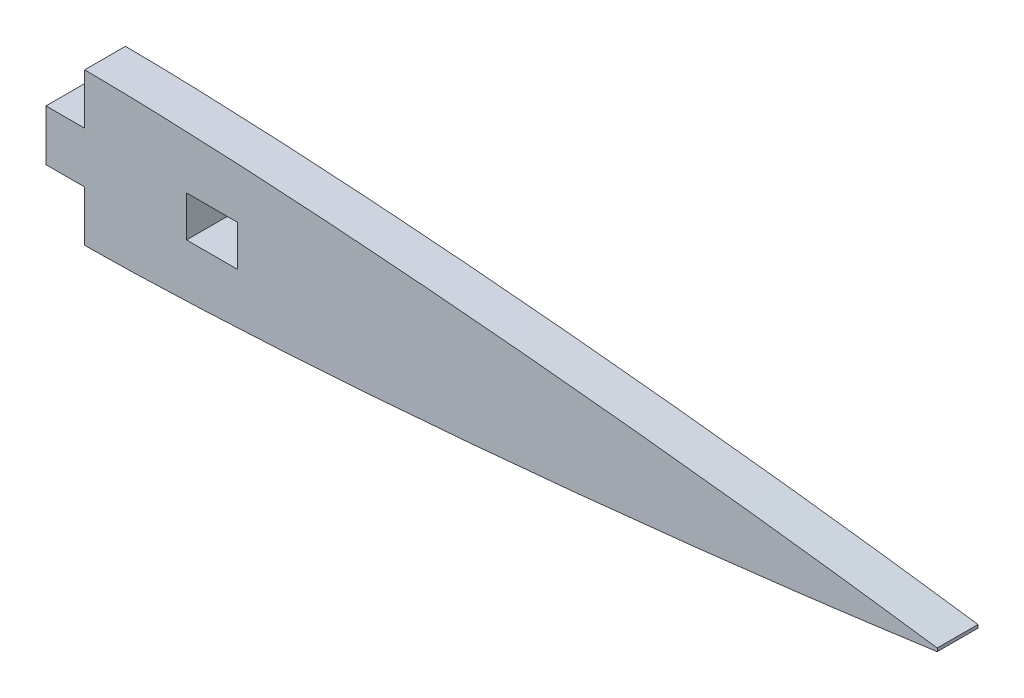
ISO-10303-21;
HEADER;
FILE_DESCRIPTION(('STEP AP214'),'2;1');
FILE_NAME('part.step','',(''),(''),'','','');
FILE_SCHEMA(('AUTOMOTIVE_DESIGN { 1 0 10303 214 1 1 1 1 }'));
ENDSEC;
DATA;
#1=APPLICATION_CONTEXT('core data for automotive mechanical design processes');
#2=APPLICATION_PROTOCOL_DEFINITION('international standard','automotive_design',2000,#1);
#3=PRODUCT_CONTEXT('',#1,'mechanical');
#4=PRODUCT('Part','Part','',(#3));
#5=PRODUCT_RELATED_PRODUCT_CATEGORY('part','',(#4));
#6=PRODUCT_DEFINITION_FORMATION('','',#4);
#7=PRODUCT_DEFINITION_CONTEXT('part definition',#1,'design');
#8=PRODUCT_DEFINITION('design','',#6,#7);
#9=PRODUCT_DEFINITION_SHAPE('','',#8);
#10=(LENGTH_UNIT() NAMED_UNIT(*) SI_UNIT(.MILLI.,.METRE.));
#11=(NAMED_UNIT(*) PLANE_ANGLE_UNIT() SI_UNIT($,.RADIAN.));
#12=(NAMED_UNIT(*) SI_UNIT($,.STERADIAN.) SOLID_ANGLE_UNIT());
#13=UNCERTAINTY_MEASURE_WITH_UNIT(LENGTH_MEASURE(1.E-05),#10,'distance_accuracy_value','');
#14=(GEOMETRIC_REPRESENTATION_CONTEXT(3) GLOBAL_UNCERTAINTY_ASSIGNED_CONTEXT((#13)) GLOBAL_UNIT_ASSIGNED_CONTEXT((#10,
#11,#12)) REPRESENTATION_CONTEXT('',''));
#15=CARTESIAN_POINT('',(0.,0.,0.));
#16=DIRECTION('',(0.,0.,1.));
#17=DIRECTION('',(1.,0.,0.));
#18=AXIS2_PLACEMENT_3D('',#15,#16,#17);
#19=CARTESIAN_POINT('',(47.625,-9.52576331040314,5.08));
#20=CARTESIAN_POINT('',(50.2177356566735,-9.48719248214332,5.08));
#21=CARTESIAN_POINT('',(55.4582966324732,-9.48903947983647,5.08));
#22=CARTESIAN_POINT('',(63.3434162274875,-9.23480821011702,5.08));
#23=CARTESIAN_POINT('',(71.3345095377818,-8.88842608962695,5.08));
#24=CARTESIAN_POINT('',(79.324754405376,-8.42059946297436,5.08));
#25=CARTESIAN_POINT('',(87.3152385206949,-7.87391719763501,5.08));
#26=CARTESIAN_POINT('',(95.252619426882,-7.25396232739253,5.08));
#27=CARTESIAN_POINT('',(103.190287717265,-6.57149538859201,5.08));
#28=CARTESIAN_POINT('',(111.127662781583,-5.82540228155454,5.08));
#29=CARTESIAN_POINT('',(119.065195908497,-5.02492375961748,5.08));
#30=CARTESIAN_POINT('',(127.002836923673,-4.17220658565676,5.08));
#31=CARTESIAN_POINT('',(134.940769513473,-3.26840822682621,5.08));
#32=CARTESIAN_POINT('',(142.878358215207,-2.30671923378164,5.08));
#33=CARTESIAN_POINT('',(150.817056987184,-1.29426944217571,5.08));
#34=CARTESIAN_POINT('',(156.104769638528,-0.56489950075565,5.08));
#35=CARTESIAN_POINT('',(158.750000000014,-0.200024999999788,5.08));
#36=B_SPLINE_CURVE_WITH_KNOTS('',3,(#19,#20,#21,#22,#23,#24,#25,#26,#27,#28,#29,#30,#31,#32,#33,
#34,#35),.UNSPECIFIED.,.F.,.F.,(4,1,1,1,1,1,1,1,1,1,1,1,1,1,4),(0.656846271918045,
0.680768176909528,0.70518703148146,0.729619521717807,0.754557907488244,0.779023813920224,
0.803506447849447,0.828005419452442,0.852521438169042,0.87705400352829,0.901603249022864,
0.926170219757915,0.950757129502437,0.975365768770781,1.),.UNSPECIFIED.);
#37=DIRECTION('',(0.,0.,-1.));
#38=VECTOR('',#37,1.);
#39=SURFACE_OF_LINEAR_EXTRUSION('',#36,#38);
#40=CARTESIAN_POINT('',(52.4510000000001,-9.48015605351682,5.08));
#41=VERTEX_POINT('',#40);
#42=CARTESIAN_POINT('',(158.750000000014,-0.200024999999788,5.08));
#43=VERTEX_POINT('',#42);
#44=EDGE_CURVE('E181',#41,#43,#36,.T.);
#45=ORIENTED_EDGE('',*,*,#44,.F.);
#46=DIRECTION('',(0.,0.,-1.));
#47=VECTOR('',#46,1.);
#48=CARTESIAN_POINT('',(52.4510000000001,-9.48015605351683,5.08));
#49=LINE('',#48,#47);
#50=CARTESIAN_POINT('',(52.4510000000001,-9.48015605351682,0.));
#51=VERTEX_POINT('',#50);
#52=EDGE_CURVE('E168',#41,#51,#49,.T.);
#53=ORIENTED_EDGE('',*,*,#52,.T.);
#54=CARTESIAN_POINT('',(47.625,-9.52576331040314,0.));
#55=CARTESIAN_POINT('',(50.2177356566735,-9.48719248214332,0.));
#56=CARTESIAN_POINT('',(55.4582966324732,-9.48903947983647,0.));
#57=CARTESIAN_POINT('',(63.3434162274875,-9.23480821011702,0.));
#58=CARTESIAN_POINT('',(71.3345095377818,-8.88842608962695,0.));
#59=CARTESIAN_POINT('',(79.324754405376,-8.42059946297436,0.));
#60=CARTESIAN_POINT('',(87.3152385206949,-7.87391719763501,0.));
#61=CARTESIAN_POINT('',(95.252619426882,-7.25396232739253,0.));
#62=CARTESIAN_POINT('',(103.190287717265,-6.57149538859201,0.));
#63=CARTESIAN_POINT('',(111.127662781583,-5.82540228155454,0.));
#64=CARTESIAN_POINT('',(119.065195908497,-5.02492375961748,0.));
#65=CARTESIAN_POINT('',(127.002836923673,-4.17220658565676,0.));
#66=CARTESIAN_POINT('',(134.940769513473,-3.26840822682621,0.));
#67=CARTESIAN_POINT('',(142.878358215207,-2.30671923378164,0.));
#68=CARTESIAN_POINT('',(150.817056987184,-1.29426944217571,0.));
#69=CARTESIAN_POINT('',(156.104769638528,-0.56489950075565,0.));
#70=CARTESIAN_POINT('',(158.750000000014,-0.200024999999788,0.));
#71=B_SPLINE_CURVE_WITH_KNOTS('',3,(#54,#55,#56,#57,#58,#59,#60,#61,#62,#63,#64,#65,#66,#67,#68,
#69,#70),.UNSPECIFIED.,.F.,.F.,(4,1,1,1,1,1,1,1,1,1,1,1,1,1,4),(0.656846271918045,
0.680768176909528,0.70518703148146,0.729619521717807,0.754557907488244,0.779023813920224,
0.803506447849447,0.828005419452442,0.852521438169042,0.87705400352829,0.901603249022864,
0.926170219757915,0.950757129502437,0.975365768770781,1.),.UNSPECIFIED.);
#72=CARTESIAN_POINT('',(158.750000000014,-0.200024999999788,0.));
#73=VERTEX_POINT('',#72);
#74=EDGE_CURVE('E163',#51,#73,#71,.T.);
#75=ORIENTED_EDGE('',*,*,#74,.T.);
#76=DIRECTION('',(0.,0.,-1.));
#77=VECTOR('',#76,1.);
#78=CARTESIAN_POINT('',(158.750000000014,-0.200024999999788,5.08));
#79=LINE('',#78,#77);
#80=EDGE_CURVE('E41',#43,#73,#79,.T.);
#81=ORIENTED_EDGE('',*,*,#80,.F.);
#82=EDGE_LOOP('',(#45,#53,#75,#81));
#83=FACE_BOUND('',#82,.T.);
#84=ADVANCED_FACE('F33',(#83),#39,.F.);
#85=CARTESIAN_POINT('',(158.750000000014,-0.200024999999788,5.08));
#86=DIRECTION('',(-1.,0.,0.));
#87=DIRECTION('',(0.,0.,1.));
#88=AXIS2_PLACEMENT_3D('',#85,#86,#87);
#89=PLANE('',#88);
#90=DIRECTION('',(0.,1.,0.));
#91=VECTOR('',#90,1.);
#92=CARTESIAN_POINT('',(158.750000000014,-0.200024999999788,0.));
#93=LINE('',#92,#91);
#94=CARTESIAN_POINT('',(158.750000000014,0.200025000170092,0.));
#95=VERTEX_POINT('',#94);
#96=EDGE_CURVE('E167',#73,#95,#93,.T.);
#97=ORIENTED_EDGE('',*,*,#96,.T.);
#98=DIRECTION('',(0.,0.,-1.));
#99=VECTOR('',#98,1.);
#100=CARTESIAN_POINT('',(158.750000000014,0.200025000170092,5.08));
#101=LINE('',#100,#99);
#102=CARTESIAN_POINT('',(158.750000000014,0.200025000170092,5.08));
#103=VERTEX_POINT('',#102);
#104=EDGE_CURVE('E150',#103,#95,#101,.T.);
#105=ORIENTED_EDGE('',*,*,#104,.F.);
#106=DIRECTION('',(0.,1.,0.));
#107=VECTOR('',#106,1.);
#108=CARTESIAN_POINT('',(158.750000000014,-0.200024999999788,5.08));
#109=LINE('',#108,#107);
#110=EDGE_CURVE('E156',#43,#103,#109,.T.);
#111=ORIENTED_EDGE('',*,*,#110,.F.);
#112=ORIENTED_EDGE('',*,*,#80,.T.);
#113=EDGE_LOOP('',(#97,#105,#111,#112));
#114=FACE_BOUND('',#113,.T.);
#115=ADVANCED_FACE('F186',(#114),#89,.F.);
#116=CARTESIAN_POINT('',(158.750000000014,0.200025000170092,5.08));
#117=CARTESIAN_POINT('',(156.104769638527,0.564899500921906,5.08));
#118=CARTESIAN_POINT('',(150.817056987182,1.29426944233387,5.08));
#119=CARTESIAN_POINT('',(142.878358215204,2.30671923392764,5.08));
#120=CARTESIAN_POINT('',(134.940769513469,3.26840822696008,5.08));
#121=CARTESIAN_POINT('',(127.002836923667,4.17220658577847,5.08));
#122=CARTESIAN_POINT('',(119.06519590849,5.02492375972704,5.08));
#123=CARTESIAN_POINT('',(111.127662781574,5.82540228165196,5.08));
#124=CARTESIAN_POINT('',(103.190287717255,6.57149538867727,5.08));
#125=CARTESIAN_POINT('',(95.2526194268712,7.25396232746564,5.08));
#126=CARTESIAN_POINT('',(87.3152385206832,7.87391719769598,5.08));
#127=CARTESIAN_POINT('',(79.3247544053635,8.42059946302309,5.08));
#128=CARTESIAN_POINT('',(71.3345095377685,8.88842608966345,5.08));
#129=CARTESIAN_POINT('',(63.3434162274737,9.2348082101413,5.08));
#130=CARTESIAN_POINT('',(55.4582966324637,9.48903947984852,5.08));
#131=CARTESIAN_POINT('',(50.2177356566689,9.48719248214751,5.08));
#132=CARTESIAN_POINT('',(47.625,9.52576331040314,5.08));
#133=B_SPLINE_CURVE_WITH_KNOTS('',3,(#116,#117,#118,#119,#120,#121,#122,#123,#124,#125,#126,
#127,#128,#129,#130,#131,#132),.UNSPECIFIED.,.F.,.F.,(4,1,1,1,1,1,1,1,1,1,1,1,1,1,4),(0.,
0.0246342312292194,0.0492428704975633,0.0738297802420855,0.0983967509771365,0.12294599647171,
0.147478561830958,0.171994580547558,0.196493552150553,0.220976186079776,0.245442092511756,
0.270380478282193,0.29481296851854,0.319231823090472,0.343153728081911),.UNSPECIFIED.);
#134=DIRECTION('',(0.,0.,-1.));
#135=VECTOR('',#134,1.);
#136=SURFACE_OF_LINEAR_EXTRUSION('',#133,#135);
#137=CARTESIAN_POINT('',(158.750000000014,0.200025000170092,0.));
#138=CARTESIAN_POINT('',(156.104769638527,0.564899500921906,0.));
#139=CARTESIAN_POINT('',(150.817056987182,1.29426944233387,0.));
#140=CARTESIAN_POINT('',(142.878358215204,2.30671923392764,0.));
#141=CARTESIAN_POINT('',(134.940769513469,3.26840822696008,0.));
#142=CARTESIAN_POINT('',(127.002836923667,4.17220658577847,0.));
#143=CARTESIAN_POINT('',(119.06519590849,5.02492375972704,0.));
#144=CARTESIAN_POINT('',(111.127662781574,5.82540228165196,0.));
#145=CARTESIAN_POINT('',(103.190287717255,6.57149538867727,0.));
#146=CARTESIAN_POINT('',(95.2526194268712,7.25396232746564,0.));
#147=CARTESIAN_POINT('',(87.3152385206832,7.87391719769598,0.));
#148=CARTESIAN_POINT('',(79.3247544053635,8.42059946302309,0.));
#149=CARTESIAN_POINT('',(71.3345095377685,8.88842608966345,0.));
#150=CARTESIAN_POINT('',(63.3434162274737,9.2348082101413,0.));
#151=CARTESIAN_POINT('',(55.4582966324637,9.48903947984852,0.));
#152=CARTESIAN_POINT('',(50.2177356566689,9.48719248214751,0.));
#153=CARTESIAN_POINT('',(47.625,9.52576331040314,0.));
#154=B_SPLINE_CURVE_WITH_KNOTS('',3,(#137,#138,#139,#140,#141,#142,#143,#144,#145,#146,#147,
#148,#149,#150,#151,#152,#153),.UNSPECIFIED.,.F.,.F.,(4,1,1,1,1,1,1,1,1,1,1,1,1,1,4),(0.,
0.0246342312292194,0.0492428704975633,0.0738297802420855,0.0983967509771365,0.12294599647171,
0.147478561830958,0.171994580547558,0.196493552150553,0.220976186079776,0.245442092511756,
0.270380478282193,0.29481296851854,0.319231823090472,0.343153728081911),.UNSPECIFIED.);
#155=CARTESIAN_POINT('',(52.4510000000016,9.48015605352431,0.));
#156=VERTEX_POINT('',#155);
#157=EDGE_CURVE('E173',#95,#156,#154,.T.);
#158=ORIENTED_EDGE('',*,*,#157,.T.);
#159=DIRECTION('',(0.,0.,-1.));
#160=VECTOR('',#159,1.);
#161=CARTESIAN_POINT('',(52.4510000000001,9.48015605352432,5.08));
#162=LINE('',#161,#160);
#163=CARTESIAN_POINT('',(52.4510000000001,9.48015605352431,5.08));
#164=VERTEX_POINT('',#163);
#165=EDGE_CURVE('E202',#156,#164,#162,.F.);
#166=ORIENTED_EDGE('',*,*,#165,.T.);
#167=EDGE_CURVE('E151',#103,#164,#133,.T.);
#168=ORIENTED_EDGE('',*,*,#167,.F.);
#169=ORIENTED_EDGE('',*,*,#104,.T.);
#170=EDGE_LOOP('',(#158,#166,#168,#169));
#171=FACE_BOUND('',#170,.T.);
#172=ADVANCED_FACE('F200',(#171),#136,.F.);
#173=CARTESIAN_POINT('',(47.6250000000001,-9.52576331040314,5.08));
#174=DIRECTION('',(1.,0.,0.));
#175=DIRECTION('',(0.,1.,0.));
#176=AXIS2_PLACEMENT_3D('',#173,#174,#175);
#177=PLANE('',#176);
#178=DIRECTION('',(0.,-1.,0.));
#179=VECTOR('',#178,1.);
#180=CARTESIAN_POINT('',(47.6250000000001,-9.52576331040314,0.));
#181=LINE('',#180,#179);
#182=CARTESIAN_POINT('',(47.6250000000001,3.175,0.));
#183=VERTEX_POINT('',#182);
#184=CARTESIAN_POINT('',(47.6250000000001,-3.175,0.));
#185=VERTEX_POINT('',#184);
#186=EDGE_CURVE('E142',#183,#185,#181,.T.);
#187=ORIENTED_EDGE('',*,*,#186,.T.);
#188=DIRECTION('',(0.,0.,-1.));
#189=VECTOR('',#188,1.);
#190=CARTESIAN_POINT('',(47.6250000000001,-3.175,5.08));
#191=LINE('',#190,#189);
#192=CARTESIAN_POINT('',(47.6250000000001,-3.175,5.08));
#193=VERTEX_POINT('',#192);
#194=EDGE_CURVE('E125',#193,#185,#191,.T.);
#195=ORIENTED_EDGE('',*,*,#194,.F.);
#196=DIRECTION('',(0.,-1.,0.));
#197=VECTOR('',#196,1.);
#198=CARTESIAN_POINT('',(47.6250000000001,-9.52576331040314,5.08));
#199=LINE('',#198,#197);
#200=CARTESIAN_POINT('',(47.6250000000001,3.175,5.08));
#201=VERTEX_POINT('',#200);
#202=EDGE_CURVE('E140',#201,#193,#199,.T.);
#203=ORIENTED_EDGE('',*,*,#202,.F.);
#204=DIRECTION('',(0.,0.,-1.));
#205=VECTOR('',#204,1.);
#206=CARTESIAN_POINT('',(47.6250000000001,3.175,5.08));
#207=LINE('',#206,#205);
#208=EDGE_CURVE('E245',#201,#183,#207,.T.);
#209=ORIENTED_EDGE('',*,*,#208,.T.);
#210=EDGE_LOOP('',(#187,#195,#203,#209));
#211=FACE_BOUND('',#210,.T.);
#212=ADVANCED_FACE('F138',(#211),#177,.F.);
#213=CARTESIAN_POINT('',(103.322789619916,-6.54895422096507,5.08));
#214=DIRECTION('',(0.,0.,1.));
#215=DIRECTION('',(1.,0.,0.));
#216=AXIS2_PLACEMENT_3D('',#213,#214,#215);
#217=PLANE('',#216);
#218=DIRECTION('',(0.,-1.,0.));
#219=VECTOR('',#218,1.);
#220=CARTESIAN_POINT('',(52.4510000000001,-9.52576331040314,5.08));
#221=LINE('',#220,#219);
#222=CARTESIAN_POINT('',(52.4510000000001,-3.175,5.08));
#223=VERTEX_POINT('',#222);
#224=EDGE_CURVE('E132',#223,#41,#221,.T.);
#225=ORIENTED_EDGE('',*,*,#224,.T.);
#226=ORIENTED_EDGE('',*,*,#44,.T.);
#227=ORIENTED_EDGE('',*,*,#110,.T.);
#228=ORIENTED_EDGE('',*,*,#167,.T.);
#229=DIRECTION('',(0.,-1.,0.));
#230=VECTOR('',#229,1.);
#231=CARTESIAN_POINT('',(52.4510000000001,3.175,5.08));
#232=LINE('',#231,#230);
#233=CARTESIAN_POINT('',(52.4510000000001,3.175,5.08));
#234=VERTEX_POINT('',#233);
#235=EDGE_CURVE('E203',#164,#234,#232,.T.);
#236=ORIENTED_EDGE('',*,*,#235,.T.);
#237=DIRECTION('',(-1.,0.,0.));
#238=VECTOR('',#237,1.);
#239=CARTESIAN_POINT('',(47.6250000000001,3.175,5.08));
#240=LINE('',#239,#238);
#241=EDGE_CURVE('E149',#234,#201,#240,.T.);
#242=ORIENTED_EDGE('',*,*,#241,.T.);
#243=ORIENTED_EDGE('',*,*,#202,.T.);
#244=DIRECTION('',(1.,0.,0.));
#245=VECTOR('',#244,1.);
#246=CARTESIAN_POINT('',(47.6250000000001,-3.175,5.08));
#247=LINE('',#246,#245);
#248=EDGE_CURVE('E121',#193,#223,#247,.T.);
#249=ORIENTED_EDGE('',*,*,#248,.T.);
#250=EDGE_LOOP('',(#225,#226,#227,#228,#236,#242,#243,#249));
#251=FACE_BOUND('',#250,.T.);
#252=DIRECTION('',(0.,1.,0.));
#253=VECTOR('',#252,1.);
#254=CARTESIAN_POINT('',(65.1510000000001,-2.54,5.08));
#255=LINE('',#254,#253);
#256=CARTESIAN_POINT('',(65.1510000000001,-2.54,5.08));
#257=VERTEX_POINT('',#256);
#258=CARTESIAN_POINT('',(65.1510000000001,2.54,5.08));
#259=VERTEX_POINT('',#258);
#260=EDGE_CURVE('E226',#257,#259,#255,.T.);
#261=ORIENTED_EDGE('',*,*,#260,.T.);
#262=DIRECTION('',(1.,0.,0.));
#263=VECTOR('',#262,1.);
#264=CARTESIAN_POINT('',(65.1510000000001,2.54,5.08));
#265=LINE('',#264,#263);
#266=CARTESIAN_POINT('',(71.5010000000001,2.54,5.08));
#267=VERTEX_POINT('',#266);
#268=EDGE_CURVE('E237',#259,#267,#265,.T.);
#269=ORIENTED_EDGE('',*,*,#268,.T.);
#270=DIRECTION('',(0.,-1.,0.));
#271=VECTOR('',#270,1.);
#272=CARTESIAN_POINT('',(71.5010000000001,-2.54,5.08));
#273=LINE('',#272,#271);
#274=CARTESIAN_POINT('',(71.5010000000001,-2.54,5.08));
#275=VERTEX_POINT('',#274);
#276=EDGE_CURVE('E48',#267,#275,#273,.T.);
#277=ORIENTED_EDGE('',*,*,#276,.T.);
#278=DIRECTION('',(-1.,0.,0.));
#279=VECTOR('',#278,1.);
#280=CARTESIAN_POINT('',(65.1510000000001,-2.54,5.08));
#281=LINE('',#280,#279);
#282=EDGE_CURVE('E216',#275,#257,#281,.T.);
#283=ORIENTED_EDGE('',*,*,#282,.T.);
#284=EDGE_LOOP('',(#261,#269,#277,#283));
#285=FACE_BOUND('',#284,.T.);
#286=ADVANCED_FACE('F145',(#251,#285),#217,.T.);
#287=CARTESIAN_POINT('',(103.322789619916,-6.54895422096507,0.));
#288=DIRECTION('',(0.,0.,1.));
#289=DIRECTION('',(1.,0.,0.));
#290=AXIS2_PLACEMENT_3D('',#287,#288,#289);
#291=PLANE('',#290);
#292=DIRECTION('',(1.,0.,0.));
#293=VECTOR('',#292,1.);
#294=CARTESIAN_POINT('',(65.1510000000001,2.54,0.));
#295=LINE('',#294,#293);
#296=CARTESIAN_POINT('',(65.1510000000001,2.54,0.));
#297=VERTEX_POINT('',#296);
#298=CARTESIAN_POINT('',(71.5010000000001,2.54,0.));
#299=VERTEX_POINT('',#298);
#300=EDGE_CURVE('E230',#297,#299,#295,.T.);
#301=ORIENTED_EDGE('',*,*,#300,.F.);
#302=DIRECTION('',(0.,1.,0.));
#303=VECTOR('',#302,1.);
#304=CARTESIAN_POINT('',(65.1510000000001,-2.54,0.));
#305=LINE('',#304,#303);
#306=CARTESIAN_POINT('',(65.1510000000001,-2.54,0.));
#307=VERTEX_POINT('',#306);
#308=EDGE_CURVE('E56',#307,#297,#305,.T.);
#309=ORIENTED_EDGE('',*,*,#308,.F.);
#310=DIRECTION('',(-1.,0.,0.));
#311=VECTOR('',#310,1.);
#312=CARTESIAN_POINT('',(65.1510000000001,-2.54,0.));
#313=LINE('',#312,#311);
#314=CARTESIAN_POINT('',(71.5010000000001,-2.54,0.));
#315=VERTEX_POINT('',#314);
#316=EDGE_CURVE('E223',#315,#307,#313,.T.);
#317=ORIENTED_EDGE('',*,*,#316,.F.);
#318=DIRECTION('',(0.,-1.,0.));
#319=VECTOR('',#318,1.);
#320=CARTESIAN_POINT('',(71.5010000000001,-2.54,0.));
#321=LINE('',#320,#319);
#322=EDGE_CURVE('E227',#299,#315,#321,.T.);
#323=ORIENTED_EDGE('',*,*,#322,.F.);
#324=EDGE_LOOP('',(#301,#309,#317,#323));
#325=FACE_BOUND('',#324,.T.);
#326=ORIENTED_EDGE('',*,*,#74,.F.);
#327=DIRECTION('',(0.,-1.,0.));
#328=VECTOR('',#327,1.);
#329=CARTESIAN_POINT('',(52.4510000000001,-9.52576331040314,0.));
#330=LINE('',#329,#328);
#331=CARTESIAN_POINT('',(52.4510000000001,-3.175,0.));
#332=VERTEX_POINT('',#331);
#333=EDGE_CURVE('E133',#332,#51,#330,.T.);
#334=ORIENTED_EDGE('',*,*,#333,.F.);
#335=DIRECTION('',(1.,0.,0.));
#336=VECTOR('',#335,1.);
#337=CARTESIAN_POINT('',(47.6250000000001,-3.175,0.));
#338=LINE('',#337,#336);
#339=EDGE_CURVE('E247',#185,#332,#338,.T.);
#340=ORIENTED_EDGE('',*,*,#339,.F.);
#341=ORIENTED_EDGE('',*,*,#186,.F.);
#342=DIRECTION('',(-1.,0.,0.));
#343=VECTOR('',#342,1.);
#344=CARTESIAN_POINT('',(47.6250000000001,3.175,0.));
#345=LINE('',#344,#343);
#346=CARTESIAN_POINT('',(52.4510000000001,3.175,0.));
#347=VERTEX_POINT('',#346);
#348=EDGE_CURVE('E222',#347,#183,#345,.T.);
#349=ORIENTED_EDGE('',*,*,#348,.F.);
#350=DIRECTION('',(0.,1.,0.));
#351=VECTOR('',#350,1.);
#352=CARTESIAN_POINT('',(52.4510000000001,-6.54895422096507,0.));
#353=LINE('',#352,#351);
#354=EDGE_CURVE('E11',#347,#156,#353,.T.);
#355=ORIENTED_EDGE('',*,*,#354,.T.);
#356=ORIENTED_EDGE('',*,*,#157,.F.);
#357=ORIENTED_EDGE('',*,*,#96,.F.);
#358=EDGE_LOOP('',(#326,#334,#340,#341,#349,#355,#356,#357));
#359=FACE_BOUND('',#358,.T.);
#360=ADVANCED_FACE('F196',(#325,#359),#291,.F.);
#361=CARTESIAN_POINT('',(65.1510000000001,-2.54,5.08));
#362=DIRECTION('',(-1.,0.,0.));
#363=DIRECTION('',(0.,0.,1.));
#364=AXIS2_PLACEMENT_3D('',#361,#362,#363);
#365=PLANE('',#364);
#366=ORIENTED_EDGE('',*,*,#308,.T.);
#367=DIRECTION('',(0.,0.,-1.));
#368=VECTOR('',#367,1.);
#369=CARTESIAN_POINT('',(65.1510000000001,2.54,5.08));
#370=LINE('',#369,#368);
#371=EDGE_CURVE('E213',#259,#297,#370,.T.);
#372=ORIENTED_EDGE('',*,*,#371,.F.);
#373=ORIENTED_EDGE('',*,*,#260,.F.);
#374=DIRECTION('',(0.,0.,-1.));
#375=VECTOR('',#374,1.);
#376=CARTESIAN_POINT('',(65.1510000000001,-2.54,5.08));
#377=LINE('',#376,#375);
#378=EDGE_CURVE('E220',#257,#307,#377,.T.);
#379=ORIENTED_EDGE('',*,*,#378,.T.);
#380=EDGE_LOOP('',(#366,#372,#373,#379));
#381=FACE_BOUND('',#380,.T.);
#382=ADVANCED_FACE('F285',(#381),#365,.F.);
#383=CARTESIAN_POINT('',(65.1510000000001,-2.54,5.08));
#384=DIRECTION('',(0.,-1.,0.));
#385=DIRECTION('',(1.,0.,0.));
#386=AXIS2_PLACEMENT_3D('',#383,#384,#385);
#387=PLANE('',#386);
#388=ORIENTED_EDGE('',*,*,#316,.T.);
#389=ORIENTED_EDGE('',*,*,#378,.F.);
#390=ORIENTED_EDGE('',*,*,#282,.F.);
#391=DIRECTION('',(0.,0.,-1.));
#392=VECTOR('',#391,1.);
#393=CARTESIAN_POINT('',(71.5010000000001,-2.54,5.08));
#394=LINE('',#393,#392);
#395=EDGE_CURVE('E218',#275,#315,#394,.T.);
#396=ORIENTED_EDGE('',*,*,#395,.T.);
#397=EDGE_LOOP('',(#388,#389,#390,#396));
#398=FACE_BOUND('',#397,.T.);
#399=ADVANCED_FACE('F290',(#398),#387,.F.);
#400=CARTESIAN_POINT('',(71.5010000000001,-2.54,5.08));
#401=DIRECTION('',(1.,0.,0.));
#402=DIRECTION('',(0.,0.,-1.));
#403=AXIS2_PLACEMENT_3D('',#400,#401,#402);
#404=PLANE('',#403);
#405=ORIENTED_EDGE('',*,*,#322,.T.);
#406=ORIENTED_EDGE('',*,*,#395,.F.);
#407=ORIENTED_EDGE('',*,*,#276,.F.);
#408=DIRECTION('',(0.,0.,-1.));
#409=VECTOR('',#408,1.);
#410=CARTESIAN_POINT('',(71.5010000000001,2.54,5.08));
#411=LINE('',#410,#409);
#412=EDGE_CURVE('E215',#267,#299,#411,.T.);
#413=ORIENTED_EDGE('',*,*,#412,.T.);
#414=EDGE_LOOP('',(#405,#406,#407,#413));
#415=FACE_BOUND('',#414,.T.);
#416=ADVANCED_FACE('F268',(#415),#404,.F.);
#417=CARTESIAN_POINT('',(65.1510000000001,2.54,5.08));
#418=DIRECTION('',(0.,1.,0.));
#419=DIRECTION('',(-1.,0.,0.));
#420=AXIS2_PLACEMENT_3D('',#417,#418,#419);
#421=PLANE('',#420);
#422=ORIENTED_EDGE('',*,*,#300,.T.);
#423=ORIENTED_EDGE('',*,*,#412,.F.);
#424=ORIENTED_EDGE('',*,*,#268,.F.);
#425=ORIENTED_EDGE('',*,*,#371,.T.);
#426=EDGE_LOOP('',(#422,#423,#424,#425));
#427=FACE_BOUND('',#426,.T.);
#428=ADVANCED_FACE('F261',(#427),#421,.F.);
#429=CARTESIAN_POINT('',(52.4510000000001,3.175,5.08));
#430=DIRECTION('',(1.,0.,0.));
#431=DIRECTION('',(0.,0.,-1.));
#432=AXIS2_PLACEMENT_3D('',#429,#430,#431);
#433=PLANE('',#432);
#434=ORIENTED_EDGE('',*,*,#354,.F.);
#435=DIRECTION('',(0.,0.,-1.));
#436=VECTOR('',#435,1.);
#437=CARTESIAN_POINT('',(52.4510000000001,3.175,5.08));
#438=LINE('',#437,#436);
#439=EDGE_CURVE('E242',#234,#347,#438,.T.);
#440=ORIENTED_EDGE('',*,*,#439,.F.);
#441=ORIENTED_EDGE('',*,*,#235,.F.);
#442=ORIENTED_EDGE('',*,*,#165,.F.);
#443=EDGE_LOOP('',(#434,#440,#441,#442));
#444=FACE_BOUND('',#443,.T.);
#445=ADVANCED_FACE('F259',(#444),#433,.F.);
#446=CARTESIAN_POINT('',(47.6250000000001,3.175,5.08));
#447=DIRECTION('',(0.,-1.,0.));
#448=DIRECTION('',(1.,0.,0.));
#449=AXIS2_PLACEMENT_3D('',#446,#447,#448);
#450=PLANE('',#449);
#451=ORIENTED_EDGE('',*,*,#348,.T.);
#452=ORIENTED_EDGE('',*,*,#208,.F.);
#453=ORIENTED_EDGE('',*,*,#241,.F.);
#454=ORIENTED_EDGE('',*,*,#439,.T.);
#455=EDGE_LOOP('',(#451,#452,#453,#454));
#456=FACE_BOUND('',#455,.T.);
#457=ADVANCED_FACE('F257',(#456),#450,.F.);
#458=CARTESIAN_POINT('',(52.4510000000001,-9.52576331040314,5.08));
#459=DIRECTION('',(1.,0.,0.));
#460=DIRECTION('',(0.,0.,-1.));
#461=AXIS2_PLACEMENT_3D('',#458,#459,#460);
#462=PLANE('',#461);
#463=ORIENTED_EDGE('',*,*,#224,.F.);
#464=DIRECTION('',(0.,0.,-1.));
#465=VECTOR('',#464,1.);
#466=CARTESIAN_POINT('',(52.4510000000001,-3.175,5.08));
#467=LINE('',#466,#465);
#468=EDGE_CURVE('E127',#223,#332,#467,.T.);
#469=ORIENTED_EDGE('',*,*,#468,.T.);
#470=ORIENTED_EDGE('',*,*,#333,.T.);
#471=ORIENTED_EDGE('',*,*,#52,.F.);
#472=EDGE_LOOP('',(#463,#469,#470,#471));
#473=FACE_BOUND('',#472,.T.);
#474=ADVANCED_FACE('F255',(#473),#462,.F.);
#475=CARTESIAN_POINT('',(47.6250000000001,-3.175,5.08));
#476=DIRECTION('',(0.,1.,0.));
#477=DIRECTION('',(-1.,0.,0.));
#478=AXIS2_PLACEMENT_3D('',#475,#476,#477);
#479=PLANE('',#478);
#480=ORIENTED_EDGE('',*,*,#339,.T.);
#481=ORIENTED_EDGE('',*,*,#468,.F.);
#482=ORIENTED_EDGE('',*,*,#248,.F.);
#483=ORIENTED_EDGE('',*,*,#194,.T.);
#484=EDGE_LOOP('',(#480,#481,#482,#483));
#485=FACE_BOUND('',#484,.T.);
#486=ADVANCED_FACE('F124',(#485),#479,.F.);
#487=CLOSED_SHELL('',(#84,#115,#172,#212,#286,#360,#382,#399,#416,#428,#445,#457,#474,#486));
#488=MANIFOLD_SOLID_BREP('B2',#487);
#489=ADVANCED_BREP_SHAPE_REPRESENTATION('',(#18,#488),#14);
#490=SHAPE_DEFINITION_REPRESENTATION(#9,#489);
ENDSEC;
END-ISO-10303-21;
